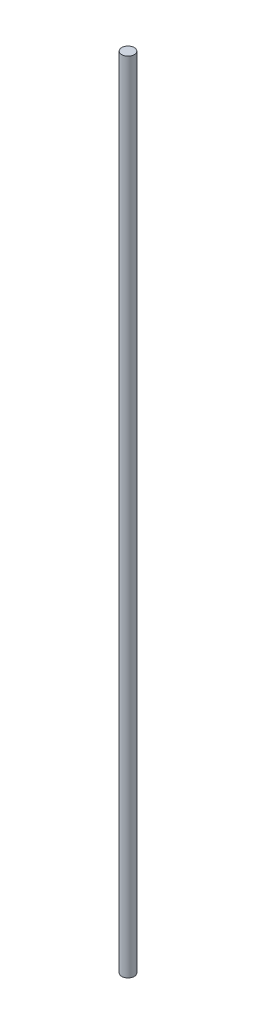
ISO-10303-21;
HEADER;
FILE_DESCRIPTION(('STEP AP214'),'2;1');
FILE_NAME('part.step','',(''),(''),'','','');
FILE_SCHEMA(('AUTOMOTIVE_DESIGN { 1 0 10303 214 1 1 1 1 }'));
ENDSEC;
DATA;
#1=APPLICATION_CONTEXT('core data for automotive mechanical design processes');
#2=APPLICATION_PROTOCOL_DEFINITION('international standard','automotive_design',2000,#1);
#3=PRODUCT_CONTEXT('',#1,'mechanical');
#4=PRODUCT('Part','Part','',(#3));
#5=PRODUCT_RELATED_PRODUCT_CATEGORY('part','',(#4));
#6=PRODUCT_DEFINITION_FORMATION('','',#4);
#7=PRODUCT_DEFINITION_CONTEXT('part definition',#1,'design');
#8=PRODUCT_DEFINITION('design','',#6,#7);
#9=PRODUCT_DEFINITION_SHAPE('','',#8);
#10=(LENGTH_UNIT() NAMED_UNIT(*) SI_UNIT(.MILLI.,.METRE.));
#11=(NAMED_UNIT(*) PLANE_ANGLE_UNIT() SI_UNIT($,.RADIAN.));
#12=(NAMED_UNIT(*) SI_UNIT($,.STERADIAN.) SOLID_ANGLE_UNIT());
#13=UNCERTAINTY_MEASURE_WITH_UNIT(LENGTH_MEASURE(1.E-05),#10,'distance_accuracy_value','');
#14=(GEOMETRIC_REPRESENTATION_CONTEXT(3) GLOBAL_UNCERTAINTY_ASSIGNED_CONTEXT((#13)) GLOBAL_UNIT_ASSIGNED_CONTEXT((#10,
#11,#12)) REPRESENTATION_CONTEXT('',''));
#15=CARTESIAN_POINT('',(0.,0.,0.));
#16=DIRECTION('',(0.,0.,1.));
#17=DIRECTION('',(1.,0.,0.));
#18=AXIS2_PLACEMENT_3D('',#15,#16,#17);
#19=CARTESIAN_POINT('',(0.,304.8,0.));
#20=DIRECTION('',(0.,-1.,0.));
#21=DIRECTION('',(0.,0.,-1.));
#22=AXIS2_PLACEMENT_3D('',#19,#20,#21);
#23=CYLINDRICAL_SURFACE('',#22,2.38125);
#24=CARTESIAN_POINT('',(0.,304.8,0.));
#25=DIRECTION('',(0.,1.,0.));
#26=DIRECTION('',(0.,0.,1.));
#27=AXIS2_PLACEMENT_3D('',#24,#25,#26);
#28=CIRCLE('',#27,2.38125);
#29=CARTESIAN_POINT('',(0.,304.8,2.38125));
#30=VERTEX_POINT('',#29);
#31=EDGE_CURVE('E10',#30,#30,#28,.T.);
#32=ORIENTED_EDGE('',*,*,#31,.F.);
#33=EDGE_LOOP('',(#32));
#34=FACE_BOUND('',#33,.T.);
#35=CARTESIAN_POINT('',(0.,0.,0.));
#36=DIRECTION('',(0.,1.,0.));
#37=DIRECTION('',(0.,0.,1.));
#38=AXIS2_PLACEMENT_3D('',#35,#36,#37);
#39=CIRCLE('',#38,2.38125);
#40=CARTESIAN_POINT('',(0.,0.,2.38125));
#41=VERTEX_POINT('',#40);
#42=EDGE_CURVE('E34',#41,#41,#39,.T.);
#43=ORIENTED_EDGE('',*,*,#42,.T.);
#44=EDGE_LOOP('',(#43));
#45=FACE_BOUND('',#44,.T.);
#46=ADVANCED_FACE('F31',(#34,#45),#23,.T.);
#47=CARTESIAN_POINT('',(0.,304.8,0.));
#48=DIRECTION('',(0.,1.,0.));
#49=DIRECTION('',(0.,0.,1.));
#50=AXIS2_PLACEMENT_3D('',#47,#48,#49);
#51=PLANE('',#50);
#52=ORIENTED_EDGE('',*,*,#31,.T.);
#53=EDGE_LOOP('',(#52));
#54=FACE_BOUND('',#53,.T.);
#55=ADVANCED_FACE('F46',(#54),#51,.T.);
#56=CARTESIAN_POINT('',(0.,0.,0.));
#57=DIRECTION('',(0.,1.,0.));
#58=DIRECTION('',(0.,0.,1.));
#59=AXIS2_PLACEMENT_3D('',#56,#57,#58);
#60=PLANE('',#59);
#61=ORIENTED_EDGE('',*,*,#42,.F.);
#62=EDGE_LOOP('',(#61));
#63=FACE_BOUND('',#62,.T.);
#64=ADVANCED_FACE('F44',(#63),#60,.F.);
#65=CLOSED_SHELL('',(#46,#55,#64));
#66=MANIFOLD_SOLID_BREP('B2',#65);
#67=ADVANCED_BREP_SHAPE_REPRESENTATION('',(#18,#66),#14);
#68=SHAPE_DEFINITION_REPRESENTATION(#9,#67);
ENDSEC;
END-ISO-10303-21;
